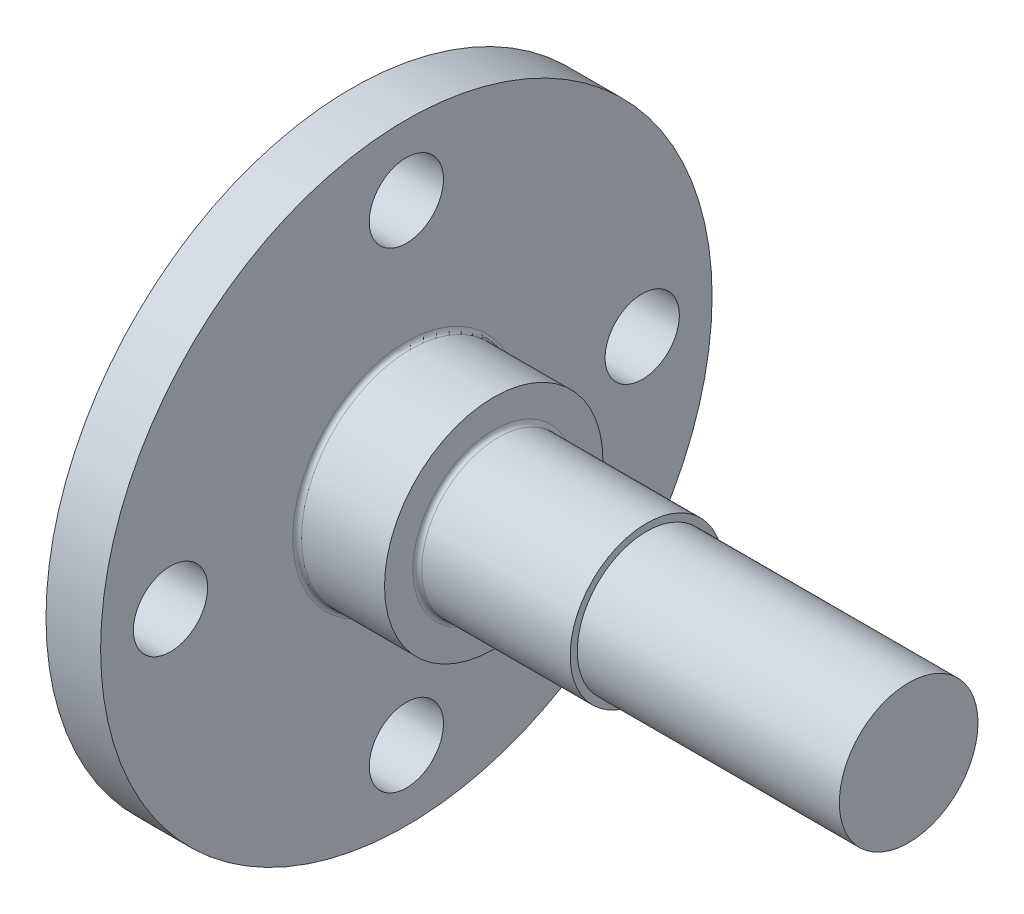
ISO-10303-21;
HEADER;
FILE_DESCRIPTION(('STEP AP214'),'2;1');
FILE_NAME('part.step','',(''),(''),'','','');
FILE_SCHEMA(('AUTOMOTIVE_DESIGN { 1 0 10303 214 1 1 1 1 }'));
ENDSEC;
DATA;
#1=APPLICATION_CONTEXT('core data for automotive mechanical design processes');
#2=APPLICATION_PROTOCOL_DEFINITION('international standard','automotive_design',2000,#1);
#3=PRODUCT_CONTEXT('',#1,'mechanical');
#4=PRODUCT('Part','Part','',(#3));
#5=PRODUCT_RELATED_PRODUCT_CATEGORY('part','',(#4));
#6=PRODUCT_DEFINITION_FORMATION('','',#4);
#7=PRODUCT_DEFINITION_CONTEXT('part definition',#1,'design');
#8=PRODUCT_DEFINITION('design','',#6,#7);
#9=PRODUCT_DEFINITION_SHAPE('','',#8);
#10=(LENGTH_UNIT() NAMED_UNIT(*) SI_UNIT(.MILLI.,.METRE.));
#11=(NAMED_UNIT(*) PLANE_ANGLE_UNIT() SI_UNIT($,.RADIAN.));
#12=(NAMED_UNIT(*) SI_UNIT($,.STERADIAN.) SOLID_ANGLE_UNIT());
#13=UNCERTAINTY_MEASURE_WITH_UNIT(LENGTH_MEASURE(1.E-05),#10,'distance_accuracy_value','');
#14=(GEOMETRIC_REPRESENTATION_CONTEXT(3) GLOBAL_UNCERTAINTY_ASSIGNED_CONTEXT((#13)) GLOBAL_UNIT_ASSIGNED_CONTEXT((#10,
#11,#12)) REPRESENTATION_CONTEXT('',''));
#15=CARTESIAN_POINT('',(0.,0.,0.));
#16=DIRECTION('',(0.,0.,1.));
#17=DIRECTION('',(1.,0.,0.));
#18=AXIS2_PLACEMENT_3D('',#15,#16,#17);
#19=CARTESIAN_POINT('',(0.,17.,60.));
#20=DIRECTION('',(1.,0.,0.));
#21=DIRECTION('',(0.,0.,-1.));
#22=AXIS2_PLACEMENT_3D('',#19,#20,#21);
#23=CYLINDRICAL_SURFACE('',#22,14.);
#24=CARTESIAN_POINT('',(5.,17.,60.));
#25=DIRECTION('',(1.,0.,0.));
#26=DIRECTION('',(0.,0.,-1.));
#27=AXIS2_PLACEMENT_3D('',#24,#25,#26);
#28=CIRCLE('',#27,14.);
#29=CARTESIAN_POINT('',(5.,17.,46.));
#30=VERTEX_POINT('',#29);
#31=EDGE_CURVE('E65',#30,#30,#28,.T.);
#32=ORIENTED_EDGE('',*,*,#31,.F.);
#33=EDGE_LOOP('',(#32));
#34=FACE_BOUND('',#33,.T.);
#35=CARTESIAN_POINT('',(2.5,17.,60.));
#36=DIRECTION('',(-1.,0.,0.));
#37=DIRECTION('',(0.,0.,1.));
#38=AXIS2_PLACEMENT_3D('',#35,#36,#37);
#39=CIRCLE('',#38,14.);
#40=CARTESIAN_POINT('',(2.5,17.,74.));
#41=VERTEX_POINT('',#40);
#42=EDGE_CURVE('E82',#41,#41,#39,.F.);
#43=ORIENTED_EDGE('',*,*,#42,.T.);
#44=EDGE_LOOP('',(#43));
#45=FACE_BOUND('',#44,.T.);
#46=ADVANCED_FACE('F35',(#34,#45),#23,.T.);
#47=CARTESIAN_POINT('',(5.,17.0000000000001,70.8));
#48=DIRECTION('',(1.,0.,0.));
#49=DIRECTION('',(0.,0.,-1.));
#50=AXIS2_PLACEMENT_3D('',#47,#48,#49);
#51=CYLINDRICAL_SURFACE('',#50,1.69999999999999);
#52=CARTESIAN_POINT('',(5.,17.0000000000001,70.8));
#53=DIRECTION('',(1.,0.,0.));
#54=DIRECTION('',(0.,0.,-1.));
#55=AXIS2_PLACEMENT_3D('',#52,#53,#54);
#56=CIRCLE('',#55,1.69999999999999);
#57=CARTESIAN_POINT('',(5.,17.0000000000001,69.1));
#58=VERTEX_POINT('',#57);
#59=EDGE_CURVE('E70',#58,#58,#56,.T.);
#60=ORIENTED_EDGE('',*,*,#59,.T.);
#61=EDGE_LOOP('',(#60));
#62=FACE_BOUND('',#61,.T.);
#63=CARTESIAN_POINT('',(2.5,17.0000000000001,70.8));
#64=DIRECTION('',(-1.,0.,0.));
#65=DIRECTION('',(0.,0.,1.));
#66=AXIS2_PLACEMENT_3D('',#63,#64,#65);
#67=CIRCLE('',#66,1.69999999999999);
#68=CARTESIAN_POINT('',(2.5,17.0000000000001,72.5));
#69=VERTEX_POINT('',#68);
#70=EDGE_CURVE('E85',#69,#69,#67,.F.);
#71=ORIENTED_EDGE('',*,*,#70,.F.);
#72=EDGE_LOOP('',(#71));
#73=FACE_BOUND('',#72,.T.);
#74=ADVANCED_FACE('F118',(#62,#73),#51,.F.);
#75=CARTESIAN_POINT('',(5.,6.2,60.0000000000001));
#76=DIRECTION('',(1.,0.,0.));
#77=DIRECTION('',(0.,0.,-1.));
#78=AXIS2_PLACEMENT_3D('',#75,#76,#77);
#79=CYLINDRICAL_SURFACE('',#78,1.69999999999999);
#80=CARTESIAN_POINT('',(5.,6.2,60.0000000000001));
#81=DIRECTION('',(1.,0.,0.));
#82=DIRECTION('',(0.,0.,-1.));
#83=AXIS2_PLACEMENT_3D('',#80,#81,#82);
#84=CIRCLE('',#83,1.69999999999999);
#85=CARTESIAN_POINT('',(5.,6.2,58.3000000000001));
#86=VERTEX_POINT('',#85);
#87=EDGE_CURVE('E73',#86,#86,#84,.T.);
#88=ORIENTED_EDGE('',*,*,#87,.T.);
#89=EDGE_LOOP('',(#88));
#90=FACE_BOUND('',#89,.T.);
#91=CARTESIAN_POINT('',(2.5,6.2,60.0000000000001));
#92=DIRECTION('',(-1.,0.,0.));
#93=DIRECTION('',(0.,0.,1.));
#94=AXIS2_PLACEMENT_3D('',#91,#92,#93);
#95=CIRCLE('',#94,1.69999999999999);
#96=CARTESIAN_POINT('',(2.5,6.2,61.7000000000001));
#97=VERTEX_POINT('',#96);
#98=EDGE_CURVE('E88',#97,#97,#95,.F.);
#99=ORIENTED_EDGE('',*,*,#98,.F.);
#100=EDGE_LOOP('',(#99));
#101=FACE_BOUND('',#100,.T.);
#102=ADVANCED_FACE('F113',(#90,#101),#79,.F.);
#103=CARTESIAN_POINT('',(5.,17.,49.2));
#104=DIRECTION('',(1.,0.,0.));
#105=DIRECTION('',(0.,0.,-1.));
#106=AXIS2_PLACEMENT_3D('',#103,#104,#105);
#107=CYLINDRICAL_SURFACE('',#106,1.69999999999999);
#108=CARTESIAN_POINT('',(5.,17.,49.2));
#109=DIRECTION('',(1.,0.,0.));
#110=DIRECTION('',(0.,0.,-1.));
#111=AXIS2_PLACEMENT_3D('',#108,#109,#110);
#112=CIRCLE('',#111,1.69999999999999);
#113=CARTESIAN_POINT('',(5.,17.,47.5));
#114=VERTEX_POINT('',#113);
#115=EDGE_CURVE('E76',#114,#114,#112,.T.);
#116=ORIENTED_EDGE('',*,*,#115,.T.);
#117=EDGE_LOOP('',(#116));
#118=FACE_BOUND('',#117,.T.);
#119=CARTESIAN_POINT('',(2.5,17.,49.2));
#120=DIRECTION('',(-1.,0.,0.));
#121=DIRECTION('',(0.,0.,1.));
#122=AXIS2_PLACEMENT_3D('',#119,#120,#121);
#123=CIRCLE('',#122,1.69999999999999);
#124=CARTESIAN_POINT('',(2.5,17.,50.9));
#125=VERTEX_POINT('',#124);
#126=EDGE_CURVE('E91',#125,#125,#123,.F.);
#127=ORIENTED_EDGE('',*,*,#126,.F.);
#128=EDGE_LOOP('',(#127));
#129=FACE_BOUND('',#128,.T.);
#130=ADVANCED_FACE('F103',(#118,#129),#107,.F.);
#131=CARTESIAN_POINT('',(5.,27.8,60.));
#132=DIRECTION('',(1.,0.,0.));
#133=DIRECTION('',(0.,0.,-1.));
#134=AXIS2_PLACEMENT_3D('',#131,#132,#133);
#135=CYLINDRICAL_SURFACE('',#134,1.69999999999999);
#136=CARTESIAN_POINT('',(5.,27.8,60.));
#137=DIRECTION('',(1.,0.,0.));
#138=DIRECTION('',(0.,0.,-1.));
#139=AXIS2_PLACEMENT_3D('',#136,#137,#138);
#140=CIRCLE('',#139,1.69999999999999);
#141=CARTESIAN_POINT('',(5.,27.8,58.3));
#142=VERTEX_POINT('',#141);
#143=EDGE_CURVE('E79',#142,#142,#140,.T.);
#144=ORIENTED_EDGE('',*,*,#143,.T.);
#145=EDGE_LOOP('',(#144));
#146=FACE_BOUND('',#145,.T.);
#147=CARTESIAN_POINT('',(2.5,27.8,60.));
#148=DIRECTION('',(-1.,0.,0.));
#149=DIRECTION('',(0.,0.,1.));
#150=AXIS2_PLACEMENT_3D('',#147,#148,#149);
#151=CIRCLE('',#150,1.69999999999999);
#152=CARTESIAN_POINT('',(2.5,27.8,61.7));
#153=VERTEX_POINT('',#152);
#154=EDGE_CURVE('E39',#153,#153,#151,.F.);
#155=ORIENTED_EDGE('',*,*,#154,.F.);
#156=EDGE_LOOP('',(#155));
#157=FACE_BOUND('',#156,.T.);
#158=ADVANCED_FACE('F100',(#146,#157),#135,.F.);
#159=CARTESIAN_POINT('',(5.,0.,0.));
#160=DIRECTION('',(1.,0.,0.));
#161=DIRECTION('',(0.,0.,-1.));
#162=AXIS2_PLACEMENT_3D('',#159,#160,#161);
#163=PLANE('',#162);
#164=ORIENTED_EDGE('',*,*,#143,.F.);
#165=EDGE_LOOP('',(#164));
#166=FACE_BOUND('',#165,.T.);
#167=ORIENTED_EDGE('',*,*,#115,.F.);
#168=EDGE_LOOP('',(#167));
#169=FACE_BOUND('',#168,.T.);
#170=ORIENTED_EDGE('',*,*,#87,.F.);
#171=EDGE_LOOP('',(#170));
#172=FACE_BOUND('',#171,.T.);
#173=ORIENTED_EDGE('',*,*,#59,.F.);
#174=EDGE_LOOP('',(#173));
#175=FACE_BOUND('',#174,.T.);
#176=CARTESIAN_POINT('',(5.,17.,60.));
#177=DIRECTION('',(1.,0.,0.));
#178=DIRECTION('',(0.,0.,-1.));
#179=AXIS2_PLACEMENT_3D('',#176,#177,#178);
#180=CIRCLE('',#179,5.2);
#181=CARTESIAN_POINT('',(5.,17.,54.8));
#182=VERTEX_POINT('',#181);
#183=EDGE_CURVE('E10',#182,#182,#180,.F.);
#184=ORIENTED_EDGE('',*,*,#183,.T.);
#185=EDGE_LOOP('',(#184));
#186=FACE_BOUND('',#185,.T.);
#187=ORIENTED_EDGE('',*,*,#31,.T.);
#188=EDGE_LOOP('',(#187));
#189=FACE_BOUND('',#188,.T.);
#190=ADVANCED_FACE('F102',(#166,#169,#172,#175,#186,#189),#163,.T.);
#191=CARTESIAN_POINT('',(28.,17.,60.));
#192=DIRECTION('',(-1.,0.,0.));
#193=DIRECTION('',(0.,0.,1.));
#194=AXIS2_PLACEMENT_3D('',#191,#192,#193);
#195=CYLINDRICAL_SURFACE('',#194,3.5);
#196=CARTESIAN_POINT('',(9.2,17.,60.));
#197=DIRECTION('',(1.,0.,0.));
#198=DIRECTION('',(0.,0.,-1.));
#199=AXIS2_PLACEMENT_3D('',#196,#197,#198);
#200=CIRCLE('',#199,3.5);
#201=CARTESIAN_POINT('',(9.2,17.,56.5));
#202=VERTEX_POINT('',#201);
#203=EDGE_CURVE('E52',#202,#202,#200,.T.);
#204=ORIENTED_EDGE('',*,*,#203,.T.);
#205=EDGE_LOOP('',(#204));
#206=FACE_BOUND('',#205,.T.);
#207=CARTESIAN_POINT('',(16.,17.,60.));
#208=DIRECTION('',(1.,0.,0.));
#209=DIRECTION('',(0.,0.,-1.));
#210=AXIS2_PLACEMENT_3D('',#207,#208,#209);
#211=CIRCLE('',#210,3.50000000000001);
#212=CARTESIAN_POINT('',(16.,17.,56.5));
#213=VERTEX_POINT('',#212);
#214=EDGE_CURVE('E58',#213,#213,#211,.T.);
#215=ORIENTED_EDGE('',*,*,#214,.F.);
#216=EDGE_LOOP('',(#215));
#217=FACE_BOUND('',#216,.T.);
#218=ADVANCED_FACE('F110',(#206,#217),#195,.T.);
#219=CARTESIAN_POINT('',(9.,17.,60.));
#220=DIRECTION('',(-1.,0.,0.));
#221=DIRECTION('',(0.,0.,1.));
#222=AXIS2_PLACEMENT_3D('',#219,#220,#221);
#223=CYLINDRICAL_SURFACE('',#222,5.);
#224=CARTESIAN_POINT('',(5.2,17.,60.));
#225=DIRECTION('',(1.,0.,0.));
#226=DIRECTION('',(0.,0.,-1.));
#227=AXIS2_PLACEMENT_3D('',#224,#225,#226);
#228=CIRCLE('',#227,5.);
#229=CARTESIAN_POINT('',(5.2,17.,55.));
#230=VERTEX_POINT('',#229);
#231=EDGE_CURVE('E43',#230,#230,#228,.T.);
#232=ORIENTED_EDGE('',*,*,#231,.T.);
#233=EDGE_LOOP('',(#232));
#234=FACE_BOUND('',#233,.T.);
#235=CARTESIAN_POINT('',(9.,17.,60.));
#236=DIRECTION('',(1.,0.,0.));
#237=DIRECTION('',(0.,0.,-1.));
#238=AXIS2_PLACEMENT_3D('',#235,#236,#237);
#239=CIRCLE('',#238,5.);
#240=CARTESIAN_POINT('',(9.,17.,55.));
#241=VERTEX_POINT('',#240);
#242=EDGE_CURVE('E55',#241,#241,#239,.T.);
#243=ORIENTED_EDGE('',*,*,#242,.F.);
#244=EDGE_LOOP('',(#243));
#245=FACE_BOUND('',#244,.T.);
#246=ADVANCED_FACE('F146',(#234,#245),#223,.T.);
#247=CARTESIAN_POINT('',(9.,0.,0.));
#248=DIRECTION('',(1.,0.,0.));
#249=DIRECTION('',(0.,0.,-1.));
#250=AXIS2_PLACEMENT_3D('',#247,#248,#249);
#251=PLANE('',#250);
#252=CARTESIAN_POINT('',(9.,17.,60.));
#253=DIRECTION('',(1.,0.,0.));
#254=DIRECTION('',(0.,0.,-1.));
#255=AXIS2_PLACEMENT_3D('',#252,#253,#254);
#256=CIRCLE('',#255,3.7);
#257=CARTESIAN_POINT('',(9.,17.,56.3));
#258=VERTEX_POINT('',#257);
#259=EDGE_CURVE('E47',#258,#258,#256,.F.);
#260=ORIENTED_EDGE('',*,*,#259,.T.);
#261=EDGE_LOOP('',(#260));
#262=FACE_BOUND('',#261,.T.);
#263=ORIENTED_EDGE('',*,*,#242,.T.);
#264=EDGE_LOOP('',(#263));
#265=FACE_BOUND('',#264,.T.);
#266=ADVANCED_FACE('F138',(#262,#265),#251,.T.);
#267=CARTESIAN_POINT('',(16.,17.,60.));
#268=DIRECTION('',(1.,0.,0.));
#269=DIRECTION('',(0.,0.,-1.));
#270=AXIS2_PLACEMENT_3D('',#267,#268,#269);
#271=PLANE('',#270);
#272=CARTESIAN_POINT('',(16.,17.,60.));
#273=DIRECTION('',(1.,0.,0.));
#274=DIRECTION('',(0.,0.,-1.));
#275=AXIS2_PLACEMENT_3D('',#272,#273,#274);
#276=CIRCLE('',#275,3.175);
#277=CARTESIAN_POINT('',(16.,17.,56.825));
#278=VERTEX_POINT('',#277);
#279=EDGE_CURVE('E61',#278,#278,#276,.T.);
#280=ORIENTED_EDGE('',*,*,#279,.F.);
#281=EDGE_LOOP('',(#280));
#282=FACE_BOUND('',#281,.T.);
#283=ORIENTED_EDGE('',*,*,#214,.T.);
#284=EDGE_LOOP('',(#283));
#285=FACE_BOUND('',#284,.T.);
#286=ADVANCED_FACE('F134',(#282,#285),#271,.T.);
#287=CARTESIAN_POINT('',(16.,17.,60.));
#288=DIRECTION('',(1.,0.,0.));
#289=DIRECTION('',(0.,0.,-1.));
#290=AXIS2_PLACEMENT_3D('',#287,#288,#289);
#291=CYLINDRICAL_SURFACE('',#290,3.175);
#292=ORIENTED_EDGE('',*,*,#279,.T.);
#293=EDGE_LOOP('',(#292));
#294=FACE_BOUND('',#293,.T.);
#295=CARTESIAN_POINT('',(28.,17.,60.));
#296=DIRECTION('',(1.,0.,0.));
#297=DIRECTION('',(0.,0.,-1.));
#298=AXIS2_PLACEMENT_3D('',#295,#296,#297);
#299=CIRCLE('',#298,3.175);
#300=CARTESIAN_POINT('',(28.,17.,56.825));
#301=VERTEX_POINT('',#300);
#302=EDGE_CURVE('E62',#301,#301,#299,.T.);
#303=ORIENTED_EDGE('',*,*,#302,.F.);
#304=EDGE_LOOP('',(#303));
#305=FACE_BOUND('',#304,.T.);
#306=ADVANCED_FACE('F130',(#294,#305),#291,.T.);
#307=CARTESIAN_POINT('',(28.,17.,60.));
#308=DIRECTION('',(1.,0.,0.));
#309=DIRECTION('',(0.,0.,-1.));
#310=AXIS2_PLACEMENT_3D('',#307,#308,#309);
#311=PLANE('',#310);
#312=ORIENTED_EDGE('',*,*,#302,.T.);
#313=EDGE_LOOP('',(#312));
#314=FACE_BOUND('',#313,.T.);
#315=ADVANCED_FACE('F133',(#314),#311,.T.);
#316=CARTESIAN_POINT('',(9.2,17.,60.));
#317=DIRECTION('',(1.,0.,0.));
#318=DIRECTION('',(0.,0.,-1.));
#319=AXIS2_PLACEMENT_3D('',#316,#317,#318);
#320=TOROIDAL_SURFACE('',#319,3.7,0.2);
#321=ORIENTED_EDGE('',*,*,#259,.F.);
#322=EDGE_LOOP('',(#321));
#323=FACE_BOUND('',#322,.T.);
#324=ORIENTED_EDGE('',*,*,#203,.F.);
#325=EDGE_LOOP('',(#324));
#326=FACE_BOUND('',#325,.T.);
#327=ADVANCED_FACE('F142',(#323,#326),#320,.F.);
#328=CARTESIAN_POINT('',(5.2,17.,60.));
#329=DIRECTION('',(1.,0.,0.));
#330=DIRECTION('',(0.,0.,-1.));
#331=AXIS2_PLACEMENT_3D('',#328,#329,#330);
#332=TOROIDAL_SURFACE('',#331,5.2,0.2);
#333=ORIENTED_EDGE('',*,*,#183,.F.);
#334=EDGE_LOOP('',(#333));
#335=FACE_BOUND('',#334,.T.);
#336=ORIENTED_EDGE('',*,*,#231,.F.);
#337=EDGE_LOOP('',(#336));
#338=FACE_BOUND('',#337,.T.);
#339=ADVANCED_FACE('F37',(#335,#338),#332,.F.);
#340=CARTESIAN_POINT('',(2.5,0.,74.));
#341=DIRECTION('',(-1.,0.,0.));
#342=DIRECTION('',(0.,0.,1.));
#343=AXIS2_PLACEMENT_3D('',#340,#341,#342);
#344=PLANE('',#343);
#345=ORIENTED_EDGE('',*,*,#42,.F.);
#346=EDGE_LOOP('',(#345));
#347=FACE_BOUND('',#346,.T.);
#348=ORIENTED_EDGE('',*,*,#154,.T.);
#349=EDGE_LOOP('',(#348));
#350=FACE_BOUND('',#349,.T.);
#351=ORIENTED_EDGE('',*,*,#126,.T.);
#352=EDGE_LOOP('',(#351));
#353=FACE_BOUND('',#352,.T.);
#354=ORIENTED_EDGE('',*,*,#98,.T.);
#355=EDGE_LOOP('',(#354));
#356=FACE_BOUND('',#355,.T.);
#357=ORIENTED_EDGE('',*,*,#70,.T.);
#358=EDGE_LOOP('',(#357));
#359=FACE_BOUND('',#358,.T.);
#360=ADVANCED_FACE('F98',(#347,#350,#353,#356,#359),#344,.T.);
#361=CLOSED_SHELL('',(#46,#74,#102,#130,#158,#190,#218,#246,#266,#286,#306,#315,#327,#339,#360));
#362=MANIFOLD_SOLID_BREP('B2',#361);
#363=ADVANCED_BREP_SHAPE_REPRESENTATION('',(#18,#362),#14);
#364=SHAPE_DEFINITION_REPRESENTATION(#9,#363);
ENDSEC;
END-ISO-10303-21;
